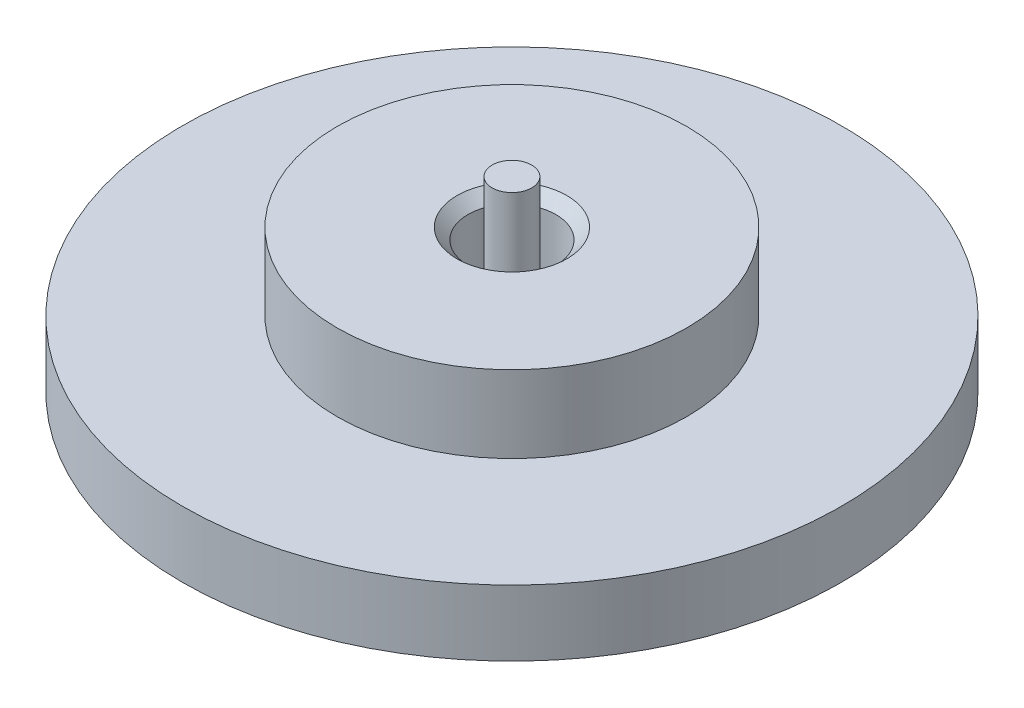
ISO-10303-21;
HEADER;
FILE_DESCRIPTION(('STEP AP214'),'2;1');
FILE_NAME('part.step','',(''),(''),'','','');
FILE_SCHEMA(('AUTOMOTIVE_DESIGN { 1 0 10303 214 1 1 1 1 }'));
ENDSEC;
DATA;
#1=APPLICATION_CONTEXT('core data for automotive mechanical design processes');
#2=APPLICATION_PROTOCOL_DEFINITION('international standard','automotive_design',2000,#1);
#3=PRODUCT_CONTEXT('',#1,'mechanical');
#4=PRODUCT('Part','Part','',(#3));
#5=PRODUCT_RELATED_PRODUCT_CATEGORY('part','',(#4));
#6=PRODUCT_DEFINITION_FORMATION('','',#4);
#7=PRODUCT_DEFINITION_CONTEXT('part definition',#1,'design');
#8=PRODUCT_DEFINITION('design','',#6,#7);
#9=PRODUCT_DEFINITION_SHAPE('','',#8);
#10=(LENGTH_UNIT() NAMED_UNIT(*) SI_UNIT(.MILLI.,.METRE.));
#11=(NAMED_UNIT(*) PLANE_ANGLE_UNIT() SI_UNIT($,.RADIAN.));
#12=(NAMED_UNIT(*) SI_UNIT($,.STERADIAN.) SOLID_ANGLE_UNIT());
#13=UNCERTAINTY_MEASURE_WITH_UNIT(LENGTH_MEASURE(1.E-05),#10,'distance_accuracy_value','');
#14=(GEOMETRIC_REPRESENTATION_CONTEXT(3) GLOBAL_UNCERTAINTY_ASSIGNED_CONTEXT((#13)) GLOBAL_UNIT_ASSIGNED_CONTEXT((#10,
#11,#12)) REPRESENTATION_CONTEXT('',''));
#15=CARTESIAN_POINT('',(0.,0.,0.));
#16=DIRECTION('',(0.,0.,1.));
#17=DIRECTION('',(1.,0.,0.));
#18=AXIS2_PLACEMENT_3D('',#15,#16,#17);
#19=CARTESIAN_POINT('',(0.,3.,0.));
#20=DIRECTION('',(0.,-1.,0.));
#21=DIRECTION('',(0.,0.,-1.));
#22=AXIS2_PLACEMENT_3D('',#19,#20,#21);
#23=CYLINDRICAL_SURFACE('',#22,15.);
#24=CARTESIAN_POINT('',(0.,3.,0.));
#25=DIRECTION('',(0.,1.,0.));
#26=DIRECTION('',(0.,0.,1.));
#27=AXIS2_PLACEMENT_3D('',#24,#25,#26);
#28=CIRCLE('',#27,15.);
#29=CARTESIAN_POINT('',(0.,3.,15.));
#30=VERTEX_POINT('',#29);
#31=EDGE_CURVE('E57',#30,#30,#28,.T.);
#32=ORIENTED_EDGE('',*,*,#31,.F.);
#33=EDGE_LOOP('',(#32));
#34=FACE_BOUND('',#33,.T.);
#35=CARTESIAN_POINT('',(0.,0.,0.));
#36=DIRECTION('',(0.,1.,0.));
#37=DIRECTION('',(0.,0.,1.));
#38=AXIS2_PLACEMENT_3D('',#35,#36,#37);
#39=CIRCLE('',#38,15.);
#40=CARTESIAN_POINT('',(0.,0.,15.));
#41=VERTEX_POINT('',#40);
#42=EDGE_CURVE('E60',#41,#41,#39,.T.);
#43=ORIENTED_EDGE('',*,*,#42,.T.);
#44=EDGE_LOOP('',(#43));
#45=FACE_BOUND('',#44,.T.);
#46=ADVANCED_FACE('F41',(#34,#45),#23,.T.);
#47=CARTESIAN_POINT('',(0.,3.,0.));
#48=DIRECTION('',(0.,1.,0.));
#49=DIRECTION('',(0.,0.,1.));
#50=AXIS2_PLACEMENT_3D('',#47,#48,#49);
#51=PLANE('',#50);
#52=CARTESIAN_POINT('',(0.,3.,0.));
#53=DIRECTION('',(0.,1.,0.));
#54=DIRECTION('',(0.,0.,1.));
#55=AXIS2_PLACEMENT_3D('',#52,#53,#54);
#56=CIRCLE('',#55,7.95);
#57=CARTESIAN_POINT('',(0.,3.,7.95));
#58=VERTEX_POINT('',#57);
#59=EDGE_CURVE('E53',#58,#58,#56,.T.);
#60=ORIENTED_EDGE('',*,*,#59,.F.);
#61=EDGE_LOOP('',(#60));
#62=FACE_BOUND('',#61,.T.);
#63=ORIENTED_EDGE('',*,*,#31,.T.);
#64=EDGE_LOOP('',(#63));
#65=FACE_BOUND('',#64,.T.);
#66=ADVANCED_FACE('F99',(#62,#65),#51,.T.);
#67=CARTESIAN_POINT('',(0.,0.,0.));
#68=DIRECTION('',(0.,1.,0.));
#69=DIRECTION('',(0.,0.,1.));
#70=AXIS2_PLACEMENT_3D('',#67,#68,#69);
#71=PLANE('',#70);
#72=ORIENTED_EDGE('',*,*,#42,.F.);
#73=EDGE_LOOP('',(#72));
#74=FACE_BOUND('',#73,.T.);
#75=ADVANCED_FACE('F105',(#74),#71,.F.);
#76=CARTESIAN_POINT('',(0.,6.5,0.));
#77=DIRECTION('',(0.,-1.,0.));
#78=DIRECTION('',(0.,0.,-1.));
#79=AXIS2_PLACEMENT_3D('',#76,#77,#78);
#80=CYLINDRICAL_SURFACE('',#79,7.95);
#81=CARTESIAN_POINT('',(0.,6.5,0.));
#82=DIRECTION('',(0.,1.,0.));
#83=DIRECTION('',(0.,0.,1.));
#84=AXIS2_PLACEMENT_3D('',#81,#82,#83);
#85=CIRCLE('',#84,7.95);
#86=CARTESIAN_POINT('',(0.,6.5,7.95));
#87=VERTEX_POINT('',#86);
#88=EDGE_CURVE('E63',#87,#87,#85,.T.);
#89=ORIENTED_EDGE('',*,*,#88,.F.);
#90=EDGE_LOOP('',(#89));
#91=FACE_BOUND('',#90,.T.);
#92=ORIENTED_EDGE('',*,*,#59,.T.);
#93=EDGE_LOOP('',(#92));
#94=FACE_BOUND('',#93,.T.);
#95=ADVANCED_FACE('F95',(#91,#94),#80,.T.);
#96=CARTESIAN_POINT('',(0.,6.5,0.));
#97=DIRECTION('',(0.,1.,0.));
#98=DIRECTION('',(0.,0.,1.));
#99=AXIS2_PLACEMENT_3D('',#96,#97,#98);
#100=PLANE('',#99);
#101=CARTESIAN_POINT('',(0.,6.5,0.));
#102=DIRECTION('',(0.,1.,0.));
#103=DIRECTION('',(0.,0.,1.));
#104=AXIS2_PLACEMENT_3D('',#101,#102,#103);
#105=CIRCLE('',#104,2.49999999999999);
#106=CARTESIAN_POINT('',(0.,6.5,2.49999999999999));
#107=VERTEX_POINT('',#106);
#108=EDGE_CURVE('E10',#107,#107,#105,.F.);
#109=ORIENTED_EDGE('',*,*,#108,.T.);
#110=EDGE_LOOP('',(#109));
#111=FACE_BOUND('',#110,.T.);
#112=ORIENTED_EDGE('',*,*,#88,.T.);
#113=EDGE_LOOP('',(#112));
#114=FACE_BOUND('',#113,.T.);
#115=ADVANCED_FACE('F89',(#111,#114),#100,.T.);
#116=CARTESIAN_POINT('',(0.,3.5,0.));
#117=DIRECTION('',(0.,1.,0.));
#118=DIRECTION('',(0.,0.,1.));
#119=AXIS2_PLACEMENT_3D('',#116,#117,#118);
#120=CYLINDRICAL_SURFACE('',#119,2.);
#121=CARTESIAN_POINT('',(0.,6.00000000000001,0.));
#122=DIRECTION('',(0.,1.,0.));
#123=DIRECTION('',(0.,0.,1.));
#124=AXIS2_PLACEMENT_3D('',#121,#122,#123);
#125=CIRCLE('',#124,2.);
#126=CARTESIAN_POINT('',(0.,6.00000000000001,2.));
#127=VERTEX_POINT('',#126);
#128=EDGE_CURVE('E49',#127,#127,#125,.T.);
#129=ORIENTED_EDGE('',*,*,#128,.T.);
#130=EDGE_LOOP('',(#129));
#131=FACE_BOUND('',#130,.T.);
#132=CARTESIAN_POINT('',(0.,3.5,0.));
#133=DIRECTION('',(0.,1.,0.));
#134=DIRECTION('',(0.,0.,1.));
#135=AXIS2_PLACEMENT_3D('',#132,#133,#134);
#136=CIRCLE('',#135,2.);
#137=CARTESIAN_POINT('',(0.,3.5,2.));
#138=VERTEX_POINT('',#137);
#139=EDGE_CURVE('E71',#138,#138,#136,.T.);
#140=ORIENTED_EDGE('',*,*,#139,.F.);
#141=EDGE_LOOP('',(#140));
#142=FACE_BOUND('',#141,.T.);
#143=ADVANCED_FACE('F84',(#131,#142),#120,.F.);
#144=CARTESIAN_POINT('',(0.,3.5,0.));
#145=DIRECTION('',(0.,1.,0.));
#146=DIRECTION('',(0.,0.,1.));
#147=AXIS2_PLACEMENT_3D('',#144,#145,#146);
#148=PLANE('',#147);
#149=CARTESIAN_POINT('',(0.,3.5,0.));
#150=DIRECTION('',(0.,1.,0.));
#151=DIRECTION('',(0.,0.,1.));
#152=AXIS2_PLACEMENT_3D('',#149,#150,#151);
#153=CIRCLE('',#152,0.9);
#154=CARTESIAN_POINT('',(0.,3.5,0.9));
#155=VERTEX_POINT('',#154);
#156=EDGE_CURVE('E74',#155,#155,#153,.T.);
#157=ORIENTED_EDGE('',*,*,#156,.F.);
#158=EDGE_LOOP('',(#157));
#159=FACE_BOUND('',#158,.T.);
#160=ORIENTED_EDGE('',*,*,#139,.T.);
#161=EDGE_LOOP('',(#160));
#162=FACE_BOUND('',#161,.T.);
#163=ADVANCED_FACE('F80',(#159,#162),#148,.T.);
#164=CARTESIAN_POINT('',(0.,8.5,0.));
#165=DIRECTION('',(0.,1.,0.));
#166=DIRECTION('',(0.,0.,1.));
#167=AXIS2_PLACEMENT_3D('',#164,#165,#166);
#168=PLANE('',#167);
#169=CARTESIAN_POINT('',(0.,8.5,0.));
#170=DIRECTION('',(0.,1.,0.));
#171=DIRECTION('',(0.,0.,1.));
#172=AXIS2_PLACEMENT_3D('',#169,#170,#171);
#173=CIRCLE('',#172,0.9);
#174=CARTESIAN_POINT('',(0.,8.5,0.9));
#175=VERTEX_POINT('',#174);
#176=EDGE_CURVE('E68',#175,#175,#173,.T.);
#177=ORIENTED_EDGE('',*,*,#176,.T.);
#178=EDGE_LOOP('',(#177));
#179=FACE_BOUND('',#178,.T.);
#180=ADVANCED_FACE('F83',(#179),#168,.T.);
#181=CARTESIAN_POINT('',(0.,8.5,0.));
#182=DIRECTION('',(0.,-1.,0.));
#183=DIRECTION('',(0.,0.,-1.));
#184=AXIS2_PLACEMENT_3D('',#181,#182,#183);
#185=CYLINDRICAL_SURFACE('',#184,0.9);
#186=ORIENTED_EDGE('',*,*,#176,.F.);
#187=EDGE_LOOP('',(#186));
#188=FACE_BOUND('',#187,.T.);
#189=ORIENTED_EDGE('',*,*,#156,.T.);
#190=EDGE_LOOP('',(#189));
#191=FACE_BOUND('',#190,.T.);
#192=ADVANCED_FACE('F78',(#188,#191),#185,.T.);
#193=CARTESIAN_POINT('',(0.,6.00000000000001,0.));
#194=DIRECTION('',(0.,1.,0.));
#195=DIRECTION('',(0.,0.,1.));
#196=AXIS2_PLACEMENT_3D('',#193,#194,#195);
#197=CONICAL_SURFACE('',#196,2.,0.785398163397445);
#198=ORIENTED_EDGE('',*,*,#108,.F.);
#199=EDGE_LOOP('',(#198));
#200=FACE_BOUND('',#199,.T.);
#201=ORIENTED_EDGE('',*,*,#128,.F.);
#202=EDGE_LOOP('',(#201));
#203=FACE_BOUND('',#202,.T.);
#204=ADVANCED_FACE('F44',(#200,#203),#197,.F.);
#205=CLOSED_SHELL('',(#46,#66,#75,#95,#115,#143,#163,#180,#192,#204));
#206=MANIFOLD_SOLID_BREP('B2',#205);
#207=ADVANCED_BREP_SHAPE_REPRESENTATION('',(#18,#206),#14);
#208=SHAPE_DEFINITION_REPRESENTATION(#9,#207);
ENDSEC;
END-ISO-10303-21;
